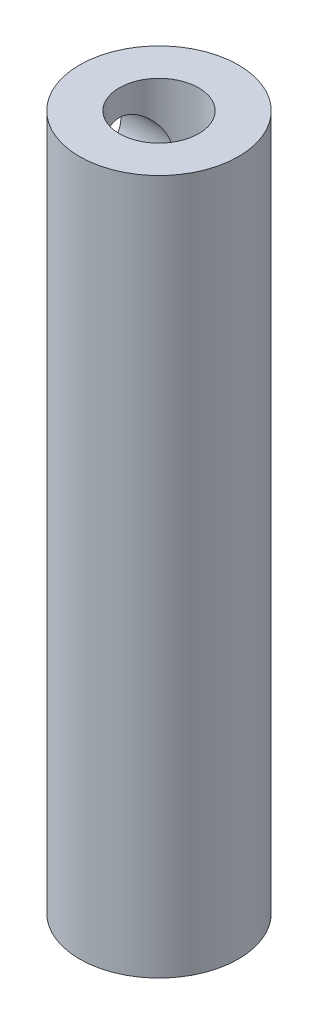
ISO-10303-21;
HEADER;
FILE_DESCRIPTION(('STEP AP214'),'2;1');
FILE_NAME('part.step','',(''),(''),'','','');
FILE_SCHEMA(('AUTOMOTIVE_DESIGN { 1 0 10303 214 1 1 1 1 }'));
ENDSEC;
DATA;
#1=APPLICATION_CONTEXT('core data for automotive mechanical design processes');
#2=APPLICATION_PROTOCOL_DEFINITION('international standard','automotive_design',2000,#1);
#3=PRODUCT_CONTEXT('',#1,'mechanical');
#4=PRODUCT('Part','Part','',(#3));
#5=PRODUCT_RELATED_PRODUCT_CATEGORY('part','',(#4));
#6=PRODUCT_DEFINITION_FORMATION('','',#4);
#7=PRODUCT_DEFINITION_CONTEXT('part definition',#1,'design');
#8=PRODUCT_DEFINITION('design','',#6,#7);
#9=PRODUCT_DEFINITION_SHAPE('','',#8);
#10=(LENGTH_UNIT() NAMED_UNIT(*) SI_UNIT(.MILLI.,.METRE.));
#11=(NAMED_UNIT(*) PLANE_ANGLE_UNIT() SI_UNIT($,.RADIAN.));
#12=(NAMED_UNIT(*) SI_UNIT($,.STERADIAN.) SOLID_ANGLE_UNIT());
#13=UNCERTAINTY_MEASURE_WITH_UNIT(LENGTH_MEASURE(1.E-05),#10,'distance_accuracy_value','');
#14=(GEOMETRIC_REPRESENTATION_CONTEXT(3) GLOBAL_UNCERTAINTY_ASSIGNED_CONTEXT((#13)) GLOBAL_UNIT_ASSIGNED_CONTEXT((#10,
#11,#12)) REPRESENTATION_CONTEXT('',''));
#15=CARTESIAN_POINT('',(0.,0.,0.));
#16=DIRECTION('',(0.,0.,1.));
#17=DIRECTION('',(1.,0.,0.));
#18=AXIS2_PLACEMENT_3D('',#15,#16,#17);
#19=CARTESIAN_POINT('',(0.,35.,0.));
#20=DIRECTION('',(0.,-1.,0.));
#21=DIRECTION('',(0.,0.,-1.));
#22=AXIS2_PLACEMENT_3D('',#19,#20,#21);
#23=CYLINDRICAL_SURFACE('',#22,4.);
#24=CARTESIAN_POINT('',(-3.62077339804634,32.,1.7));
#25=CARTESIAN_POINT('',(-3.62078389776822,31.9095136925962,1.69998931587784));
#26=CARTESIAN_POINT('',(-3.62421505367056,31.818887436566,1.69272971233163));
#27=CARTESIAN_POINT('',(-3.63750095648767,31.6402616540762,1.66397708018132));
#28=CARTESIAN_POINT('',(-3.64737281734679,31.5522697809394,1.64244612797097));
#29=CARTESIAN_POINT('',(-3.67220059629412,31.3818244806839,1.58615188365144));
#30=CARTESIAN_POINT('',(-3.68713519255218,31.2993495351598,1.55144401409242));
#31=CARTESIAN_POINT('',(-3.72037538198184,31.1414157505776,1.46994425999662));
#32=CARTESIAN_POINT('',(-3.73868027222187,31.0659554534262,1.42315489444196));
#33=CARTESIAN_POINT('',(-3.77792419156349,30.919259320318,1.31557971646441));
#34=CARTESIAN_POINT('',(-3.79895480957319,30.8485324995426,1.25413286768261));
#35=CARTESIAN_POINT('',(-3.84052932399883,30.7180095016102,1.12037385385952));
#36=CARTESIAN_POINT('',(-3.86107302551083,30.6582176392885,1.0480574201965));
#37=CARTESIAN_POINT('',(-3.90047994287595,30.5486282225362,0.890578070051302));
#38=CARTESIAN_POINT('',(-3.91922435158922,30.499408386334,0.804980679500432));
#39=CARTESIAN_POINT('',(-3.9517936883622,30.4162886166107,0.625779619556143));
#40=CARTESIAN_POINT('',(-3.96562088331569,30.3823816217372,0.532179664191152));
#41=CARTESIAN_POINT('',(-3.98614740911361,30.332710381214,0.344979513320471));
#42=CARTESIAN_POINT('',(-3.99319065604463,30.3160670178677,0.251651070591721));
#43=CARTESIAN_POINT('',(-4.00060815688424,30.2985497752618,0.0632783663420337));
#44=CARTESIAN_POINT('',(-4.00098523182037,30.2976692254058,-0.0317651523372097));
#45=CARTESIAN_POINT('',(-3.99522684956492,30.3112529689857,-0.214458466615303));
#46=CARTESIAN_POINT('',(-3.98950193441317,30.324749910631,-0.302195592459981));
#47=CARTESIAN_POINT('',(-3.97275194397345,30.3650406061082,-0.474021630551051));
#48=CARTESIAN_POINT('',(-3.96172647725524,30.3918353419478,-0.558110272867535));
#49=CARTESIAN_POINT('',(-3.93522368744884,30.4582722750843,-0.721803742779873));
#50=CARTESIAN_POINT('',(-3.91968084499471,30.4981047279113,-0.801320306141919));
#51=CARTESIAN_POINT('',(-3.88565313854627,30.5892953008207,-0.952749650325255));
#52=CARTESIAN_POINT('',(-3.86716722297728,30.640657543254,-1.02465969795704));
#53=CARTESIAN_POINT('',(-3.82750663559037,30.757800507865,-1.16440871156805));
#54=CARTESIAN_POINT('',(-3.80623419529478,30.8243594975726,-1.23156848333512));
#55=CARTESIAN_POINT('',(-3.76439681745492,30.9678239513226,-1.35407381215316));
#56=CARTESIAN_POINT('',(-3.74383217834637,31.0447337141281,-1.40941443577706));
#57=CARTESIAN_POINT('',(-3.70502399721272,31.2101401688352,-1.50855500222399));
#58=CARTESIAN_POINT('',(-3.68688823684044,31.2989504039897,-1.55187769268165));
#59=CARTESIAN_POINT('',(-3.65628757041348,31.4835805163489,-1.62267252189394));
#60=CARTESIAN_POINT('',(-3.64381842070352,31.5793950854602,-1.6501565261958));
#61=CARTESIAN_POINT('',(-3.62702749350719,31.7684983019597,-1.68672841059021));
#62=CARTESIAN_POINT('',(-3.62221773340993,31.8615291175216,-1.69692109964447));
#63=CARTESIAN_POINT('',(-3.61989322841417,32.0480762325109,-1.70187704278063));
#64=CARTESIAN_POINT('',(-3.62237578496444,32.1415923395692,-1.69664600447243));
#65=CARTESIAN_POINT('',(-3.63385039181918,32.3197683825884,-1.67191223339995));
#66=CARTESIAN_POINT('',(-3.64238974686291,32.4045989220652,-1.65340103574668));
#67=CARTESIAN_POINT('',(-3.66442865789702,32.5698728304785,-1.60396059683754));
#68=CARTESIAN_POINT('',(-3.67792940476492,32.650315140785,-1.57302837401107));
#69=CARTESIAN_POINT('',(-3.7090779402313,32.8084134508917,-1.49814807525468));
#70=CARTESIAN_POINT('',(-3.72687955099295,32.8857993962254,-1.45369590780971));
#71=CARTESIAN_POINT('',(-3.76441339227635,33.0323950596591,-1.35353226876144));
#72=CARTESIAN_POINT('',(-3.78414647967388,33.1016011185229,-1.29781578809865));
#73=CARTESIAN_POINT('',(-3.82535166604392,33.2360237838682,-1.17110429325259));
#74=CARTESIAN_POINT('',(-3.84682843975983,33.3003957330982,-1.09921112338328));
#75=CARTESIAN_POINT('',(-3.88754721100944,33.416324110372,-0.945155108949408));
#76=CARTESIAN_POINT('',(-3.90678900343043,33.4678793626733,-0.862991323245852));
#77=CARTESIAN_POINT('',(-3.94103107719546,33.556733022639,-0.689980032155145));
#78=CARTESIAN_POINT('',(-3.95601331647128,33.5939710147984,-0.599097707378483));
#79=CARTESIAN_POINT('',(-3.97989121280153,33.6523470048471,-0.411555216738269));
#80=CARTESIAN_POINT('',(-3.98879065469919,33.6734950151868,-0.314898684498714));
#81=CARTESIAN_POINT('',(-3.9990489958153,33.6977931006144,-0.126084955840315));
#82=CARTESIAN_POINT('',(-4.00090603247313,33.7021326282122,-0.0341069160918674));
#83=CARTESIAN_POINT('',(-3.99826543244609,33.6959174191764,0.149241085779918));
#84=CARTESIAN_POINT('',(-3.99376899105789,33.6853654841136,0.240611159032687));
#85=CARTESIAN_POINT('',(-3.97919382980664,33.6505207493148,0.416560481880022));
#86=CARTESIAN_POINT('',(-3.96933380737085,33.6267655308726,0.501265842353938));
#87=CARTESIAN_POINT('',(-3.94513266199835,33.5667872702492,0.665447707792311));
#88=CARTESIAN_POINT('',(-3.93079070613533,33.5305619104791,0.744923237514438));
#89=CARTESIAN_POINT('',(-3.8981931765112,33.4448358087029,0.900380438212713));
#90=CARTESIAN_POINT('',(-3.87978917350281,33.3948058369909,0.976038394360143));
#91=CARTESIAN_POINT('',(-3.84122862577445,33.2836481674676,1.118211865535));
#92=CARTESIAN_POINT('',(-3.8210714015288,33.2225161565732,1.18472380967696));
#93=CARTESIAN_POINT('',(-3.77946315895161,33.0857613862788,1.31165271688526));
#94=CARTESIAN_POINT('',(-3.75802228942074,33.0094164933923,1.37129773860273));
#95=CARTESIAN_POINT('',(-3.71772952713886,32.8471570184193,1.47705876845357));
#96=CARTESIAN_POINT('',(-3.69887912452728,32.7612369793602,1.52316700687638));
#97=CARTESIAN_POINT('',(-3.66623132404758,32.582210832153,1.60015623012625));
#98=CARTESIAN_POINT('',(-3.65241922289075,32.4891266098767,1.63108161598059));
#99=CARTESIAN_POINT('',(-3.63183106374555,32.2984664254959,1.67643974797453));
#100=CARTESIAN_POINT('',(-3.62503141264755,32.2009066860975,1.69092781340853));
#101=CARTESIAN_POINT('',(-3.62125776494451,32.0686373471819,1.69896477261701));
#102=CARTESIAN_POINT('',(-3.62076941465609,32.0343287449659,1.70000405334813));
#103=CARTESIAN_POINT('',(-3.62077339804634,32.,1.7));
#104=B_SPLINE_CURVE_WITH_KNOTS('',3,(#24,#25,#26,#27,#28,#29,#30,#31,#32,#33,#34,#35,#36,#37,
#38,#39,#40,#41,#42,#43,#44,#45,#46,#47,#48,#49,#50,#51,#52,#53,#54,#55,#56,#57,#58,#59,#60,#61,
#62,#63,#64,#65,#66,#67,#68,#69,#70,#71,#72,#73,#74,#75,#76,#77,#78,#79,#80,#81,#82,#83,#84,#85,
#86,#87,#88,#89,#90,#91,#92,#93,#94,#95,#96,#97,#98,#99,#100,#101,#102,#103),.UNSPECIFIED.,.T.,
.F.,(4,2,2,2,2,2,2,2,2,2,2,2,2,2,2,2,2,2,2,2,2,2,2,2,2,2,2,2,2,2,2,2,2,2,2,2,2,2,2,4),(0.,
0.271357429217211,0.543438849684194,0.81438834225994,1.08528138763888,1.3720970991645,
1.65902574252361,1.95899463692504,2.25882506229057,2.54250020592688,2.82605529947181,
3.09166970443069,3.35730372725016,3.62700110584538,3.89679506582232,4.18626169238784,
4.47584891000081,4.77567555447247,5.07527729092642,5.35489435511071,5.63440795890816,
5.89497300357031,6.15560063227203,6.42747562422463,6.69947178160411,6.99468311182854,
7.28992151334518,7.58639242540035,7.88267869873597,8.15756828963533,8.4324061717119,
8.69679659632972,8.96123618473687,9.23771295195231,9.51429735959075,9.81058879533077,
10.1070499625391,10.4026389106496,10.6972300845991,10.800177815029),.UNSPECIFIED.);
#105=CARTESIAN_POINT('',(-3.62077339804634,32.,1.7));
#106=VERTEX_POINT('',#105);
#107=EDGE_CURVE('E10',#106,#106,#104,.T.);
#108=ORIENTED_EDGE('',*,*,#107,.T.);
#109=EDGE_LOOP('',(#108));
#110=FACE_BOUND('',#109,.T.);
#111=CARTESIAN_POINT('',(0.,35.,0.));
#112=DIRECTION('',(0.,1.,0.));
#113=DIRECTION('',(0.,0.,1.));
#114=AXIS2_PLACEMENT_3D('',#111,#112,#113);
#115=CIRCLE('',#114,4.);
#116=CARTESIAN_POINT('',(0.,35.,4.));
#117=VERTEX_POINT('',#116);
#118=EDGE_CURVE('E40',#117,#117,#115,.T.);
#119=ORIENTED_EDGE('',*,*,#118,.F.);
#120=EDGE_LOOP('',(#119));
#121=FACE_BOUND('',#120,.T.);
#122=CARTESIAN_POINT('',(0.,0.,0.));
#123=DIRECTION('',(0.,1.,0.));
#124=DIRECTION('',(0.,0.,1.));
#125=AXIS2_PLACEMENT_3D('',#122,#123,#124);
#126=CIRCLE('',#125,4.);
#127=CARTESIAN_POINT('',(0.,0.,4.));
#128=VERTEX_POINT('',#127);
#129=EDGE_CURVE('E44',#128,#128,#126,.T.);
#130=ORIENTED_EDGE('',*,*,#129,.T.);
#131=EDGE_LOOP('',(#130));
#132=FACE_BOUND('',#131,.T.);
#133=ADVANCED_FACE('F30',(#110,#121,#132),#23,.T.);
#134=CARTESIAN_POINT('',(0.,35.,0.));
#135=DIRECTION('',(0.,1.,0.));
#136=DIRECTION('',(0.,0.,1.));
#137=AXIS2_PLACEMENT_3D('',#134,#135,#136);
#138=PLANE('',#137);
#139=CARTESIAN_POINT('',(0.,35.,0.));
#140=DIRECTION('',(0.,1.,0.));
#141=DIRECTION('',(0.,0.,1.));
#142=AXIS2_PLACEMENT_3D('',#139,#140,#141);
#143=CIRCLE('',#142,2.);
#144=CARTESIAN_POINT('',(0.,35.,2.));
#145=VERTEX_POINT('',#144);
#146=EDGE_CURVE('E51',#145,#145,#143,.T.);
#147=ORIENTED_EDGE('',*,*,#146,.F.);
#148=EDGE_LOOP('',(#147));
#149=FACE_BOUND('',#148,.T.);
#150=ORIENTED_EDGE('',*,*,#118,.T.);
#151=EDGE_LOOP('',(#150));
#152=FACE_BOUND('',#151,.T.);
#153=ADVANCED_FACE('F79',(#149,#152),#138,.T.);
#154=CARTESIAN_POINT('',(0.,0.,0.));
#155=DIRECTION('',(0.,1.,0.));
#156=DIRECTION('',(0.,0.,1.));
#157=AXIS2_PLACEMENT_3D('',#154,#155,#156);
#158=PLANE('',#157);
#159=ORIENTED_EDGE('',*,*,#129,.F.);
#160=EDGE_LOOP('',(#159));
#161=FACE_BOUND('',#160,.T.);
#162=ADVANCED_FACE('F76',(#161),#158,.F.);
#163=CARTESIAN_POINT('',(0.,25.,0.));
#164=DIRECTION('',(0.,1.,0.));
#165=DIRECTION('',(0.,0.,1.));
#166=AXIS2_PLACEMENT_3D('',#163,#164,#165);
#167=CYLINDRICAL_SURFACE('',#166,2.);
#168=CARTESIAN_POINT('',(-1.05356537528528,32.,1.7));
#169=CARTESIAN_POINT('',(-1.0535865391497,32.0579969876084,1.69999209353776));
#170=CARTESIAN_POINT('',(-1.05846416247034,32.1160712056181,1.69699341427168));
#171=CARTESIAN_POINT('',(-1.07694415181595,32.2302941941207,1.68531810769261));
#172=CARTESIAN_POINT('',(-1.09057797998307,32.2864352489887,1.67662100293753));
#173=CARTESIAN_POINT('',(-1.13108259855175,32.4180078786746,1.64968082581871));
#174=CARTESIAN_POINT('',(-1.16108669082666,32.4919371171079,1.62898823756465));
#175=CARTESIAN_POINT('',(-1.22787010969714,32.6337248046924,1.57926447079485));
#176=CARTESIAN_POINT('',(-1.26467231483019,32.701561568797,1.55020494374478));
#177=CARTESIAN_POINT('',(-1.33159048933568,32.8152672380987,1.49274984380142));
#178=CARTESIAN_POINT('',(-1.36106425910824,32.8623743748959,1.46602060494138));
#179=CARTESIAN_POINT('',(-1.4206068170519,32.9535810134619,1.40840212528898));
#180=CARTESIAN_POINT('',(-1.4506758793521,32.9976790859571,1.37751092804804));
#181=CARTESIAN_POINT('',(-1.540391428907,33.1253921130372,1.27870069797039));
#182=CARTESIAN_POINT('',(-1.59967379601292,33.204629062381,1.20454185093214));
#183=CARTESIAN_POINT('',(-1.6991559367518,33.3335598904778,1.05779848838552));
#184=CARTESIAN_POINT('',(-1.74068803635965,33.385920768851,0.988441684600398));
#185=CARTESIAN_POINT('',(-1.81701226861221,33.480650604137,0.839882315936324));
#186=CARTESIAN_POINT('',(-1.85181552120821,33.523036071839,0.760696356430929));
#187=CARTESIAN_POINT('',(-1.90658117573437,33.5891273039267,0.608501762552866));
#188=CARTESIAN_POINT('',(-1.92808383853929,33.6148170149589,0.536914240950147));
#189=CARTESIAN_POINT('',(-1.96324342803797,33.6566395251948,0.389137658874133));
#190=CARTESIAN_POINT('',(-1.97690494882648,33.6727779206503,0.312951321808487));
#191=CARTESIAN_POINT('',(-1.99531639754419,33.6944973023532,0.157641560880517));
#192=CARTESIAN_POINT('',(-2.00002539694724,33.7000298022473,0.0785063262071438));
#193=CARTESIAN_POINT('',(-1.99997440786115,33.6999699681093,-0.0797561244111584));
#194=CARTESIAN_POINT('',(-1.99521519509274,33.6943785454486,-0.158883340481886));
#195=CARTESIAN_POINT('',(-1.97736113063873,33.6733154790453,-0.308737410975696));
#196=CARTESIAN_POINT('',(-1.96490923253137,33.6586056552615,-0.379652571436747));
#197=CARTESIAN_POINT('',(-1.93315996846712,33.6208673962779,-0.517596839641206));
#198=CARTESIAN_POINT('',(-1.91386152687525,33.5978376539564,-0.584625334838861));
#199=CARTESIAN_POINT('',(-1.86781902754465,33.5424026866156,-0.718801577563779));
#200=CARTESIAN_POINT('',(-1.84060628121434,33.5093993180463,-0.785538209496984));
#201=CARTESIAN_POINT('',(-1.78109652308424,33.436229850535,-0.912480875898615));
#202=CARTESIAN_POINT('',(-1.74879554087872,33.3960581547916,-0.972681747952854));
#203=CARTESIAN_POINT('',(-1.66367783669771,33.2881848025844,-1.11444505894733));
#204=CARTESIAN_POINT('',(-1.60862821526641,33.2167072637636,-1.19180461135557));
#205=CARTESIAN_POINT('',(-1.49519576454598,33.0622669623057,-1.33134355517151));
#206=CARTESIAN_POINT('',(-1.43680588820473,32.9792793488295,-1.39348927403084));
#207=CARTESIAN_POINT('',(-1.33560565081163,32.8225278157227,-1.48992153907624));
#208=CARTESIAN_POINT('',(-1.29228603965747,32.7509944251612,-1.52732903885879));
#209=CARTESIAN_POINT('',(-1.21115764881017,32.6007563716037,-1.59240971181971));
#210=CARTESIAN_POINT('',(-1.17333262599745,32.5220740117466,-1.62011193334315));
#211=CARTESIAN_POINT('',(-1.12174912939406,32.3880115626178,-1.65598220392296));
#212=CARTESIAN_POINT('',(-1.10429085307099,32.335007261131,-1.66757817522879));
#213=CARTESIAN_POINT('',(-1.07634688979503,32.2264025966488,-1.68575136889507));
#214=CARTESIAN_POINT('',(-1.06584358593808,32.170809177588,-1.69234127787066));
#215=CARTESIAN_POINT('',(-1.05364022423823,32.0576891921143,-1.69997188075843));
#216=CARTESIAN_POINT('',(-1.05202380560274,32.0001493702366,-1.70095985458385));
#217=CARTESIAN_POINT('',(-1.05819368520095,31.8857546666464,-1.69712521354873));
#218=CARTESIAN_POINT('',(-1.06598990302157,31.8289005714107,-1.69229646870194));
#219=CARTESIAN_POINT('',(-1.09174803921428,31.7063831938381,-1.67581445898948));
#220=CARTESIAN_POINT('',(-1.11144700712543,31.6412637551221,-1.66297849578291));
#221=CARTESIAN_POINT('',(-1.15819537133674,31.5153639909899,-1.63076153967505));
#222=CARTESIAN_POINT('',(-1.18527033957442,31.4545997078671,-1.61135771876846));
#223=CARTESIAN_POINT('',(-1.23839222376261,31.3478086163342,-1.57076420948407));
#224=CARTESIAN_POINT('',(-1.26376891139426,31.3010801036612,-1.55050252767248));
#225=CARTESIAN_POINT('',(-1.31613618649843,31.2103264983711,-1.50630785201208));
#226=CARTESIAN_POINT('',(-1.34312773977883,31.166303056138,-1.48237264746023));
#227=CARTESIAN_POINT('',(-1.42515792176047,31.0379984781566,-1.40518374468282));
#228=CARTESIAN_POINT('',(-1.48122788454067,30.9575276545874,-1.34656406295446));
#229=CARTESIAN_POINT('',(-1.59308814278739,30.8038523323277,-1.21245869465718));
#230=CARTESIAN_POINT('',(-1.64876806742133,30.7310941751382,-1.13636871801782));
#231=CARTESIAN_POINT('',(-1.75240887594904,30.5990734955405,-0.968861849498815));
#232=CARTESIAN_POINT('',(-1.80039286591852,30.5397703450762,-0.877492585814875));
#233=CARTESIAN_POINT('',(-1.8705603997189,30.4542373032738,-0.711602749491723));
#234=CARTESIAN_POINT('',(-1.89611023700009,30.4234733378396,-0.64083760329226));
#235=CARTESIAN_POINT('',(-1.93962462353878,30.3713961005599,-0.493683487802223));
#236=CARTESIAN_POINT('',(-1.9575948217246,30.350075789982,-0.417298756698768));
#237=CARTESIAN_POINT('',(-1.98460480421611,30.3181172086044,-0.260242591839756));
#238=CARTESIAN_POINT('',(-1.99358857090647,30.3075459361047,-0.179547531981826));
#239=CARTESIAN_POINT('',(-2.00158035195772,30.2981390046393,-0.0169856320256852));
#240=CARTESIAN_POINT('',(-2.00059177312242,30.2992993378625,0.0648807983594134));
#241=CARTESIAN_POINT('',(-1.98932419140323,30.3125699293231,0.21907037132619));
#242=CARTESIAN_POINT('',(-1.97994433068417,30.3236204805623,0.29155638997955));
#243=CARTESIAN_POINT('',(-1.95384288748472,30.3545303540401,0.433231940291043));
#244=CARTESIAN_POINT('',(-1.93711972391115,30.3743915733211,0.50242075846762));
#245=CARTESIAN_POINT('',(-1.89653927098457,30.422962384739,0.639099574523981));
#246=CARTESIAN_POINT('',(-1.87239791787222,30.4520260370968,0.706377365385048));
#247=CARTESIAN_POINT('',(-1.81872179526714,30.5174022780211,0.834932229603046));
#248=CARTESIAN_POINT('',(-1.78918566938265,30.5537166898389,0.896207787870503));
#249=CARTESIAN_POINT('',(-1.71091060380423,30.6515005503062,1.0403705430262));
#250=CARTESIAN_POINT('',(-1.65977349850707,30.7166626502332,1.11945639862046));
#251=CARTESIAN_POINT('',(-1.55283945613768,30.8582842851909,1.26363362707695));
#252=CARTESIAN_POINT('',(-1.49702395653074,30.934789848882,1.32866519761275));
#253=CARTESIAN_POINT('',(-1.41297411987472,31.057979028225,1.41604686738013));
#254=CARTESIAN_POINT('',(-1.38462093167345,31.1009153762359,1.44370098494875));
#255=CARTESIAN_POINT('',(-1.32876164714129,31.1895686034912,1.49527077077826));
#256=CARTESIAN_POINT('',(-1.30125604387866,31.2352870568377,1.51918429479166));
#257=CARTESIAN_POINT('',(-1.24826463387982,31.3294235289084,1.56301367792193));
#258=CARTESIAN_POINT('',(-1.22277046023881,31.3778287629546,1.58294669002176));
#259=CARTESIAN_POINT('',(-1.17511740131887,31.4776773758036,1.61863632739282));
#260=CARTESIAN_POINT('',(-1.15295358494648,31.529116102618,1.63439915410738));
#261=CARTESIAN_POINT('',(-1.1139561494244,31.6348935805192,1.66122222386113));
#262=CARTESIAN_POINT('',(-1.09709510990122,31.6892156564824,1.67230676348317));
#263=CARTESIAN_POINT('',(-1.07097877600694,31.8003484786753,1.689159508811));
#264=CARTESIAN_POINT('',(-1.06169078613592,31.8571473992388,1.69495058152883));
#265=CARTESIAN_POINT('',(-1.05472385187238,31.9428584986647,1.69928151774383));
#266=CARTESIAN_POINT('',(-1.05355494602029,31.9714198720766,1.70000389619722));
#267=CARTESIAN_POINT('',(-1.05356537528528,32.,1.7));
#268=B_SPLINE_CURVE_WITH_KNOTS('',3,(#168,#169,#170,#171,#172,#173,#174,#175,#176,#177,#178,
#179,#180,#181,#182,#183,#184,#185,#186,#187,#188,#189,#190,#191,#192,#193,#194,#195,#196,#197,
#198,#199,#200,#201,#202,#203,#204,#205,#206,#207,#208,#209,#210,#211,#212,#213,#214,#215,#216,
#217,#218,#219,#220,#221,#222,#223,#224,#225,#226,#227,#228,#229,#230,#231,#232,#233,#234,#235,
#236,#237,#238,#239,#240,#241,#242,#243,#244,#245,#246,#247,#248,#249,#250,#251,#252,#253,#254,
#255,#256,#257,#258,#259,#260,#261,#262,#263,#264,#265,#266,#267),.UNSPECIFIED.,.T.,.F.,(4,2,2,
2,2,2,2,2,2,2,2,2,2,2,2,2,2,2,2,2,2,2,2,2,2,2,2,2,2,2,2,2,2,2,2,2,2,2,2,2,2,2,2,2,2,2,2,2,2,4),
(0.,0.173879418884634,0.34838713050625,0.594273916217876,0.841003812098058,1.02576540468018,
1.2106141547992,1.57953716462817,1.86747817174354,2.15493918820206,2.39107901360164,
2.6270803439883,2.86415803868535,3.1012163106546,3.32073083217672,3.54027985609209,
3.77721956251101,4.0143450798563,4.36900968073956,4.72445229908044,4.99861224866161,
5.27194447018501,5.44239988394004,5.61242186648947,5.78404131184428,5.95584177779075,
6.16238745176459,6.36965851995739,6.54014677695168,6.71073803794905,7.05207950002438,
7.40773795752544,7.76230775425531,8.00521725422385,8.24794539815097,8.49217735008232,
8.73632586906829,8.95708375667679,9.1778891991903,9.40850919092569,9.63918724678179,
9.98094346037337,10.3241264325837,10.499217898416,10.6744093682521,10.8488287825195,
11.0229873424942,11.1962299392967,11.3687205667594,11.4544059831902),.UNSPECIFIED.);
#269=CARTESIAN_POINT('',(-1.05356537528528,32.,1.7));
#270=VERTEX_POINT('',#269);
#271=EDGE_CURVE('E54',#270,#270,#268,.T.);
#272=ORIENTED_EDGE('',*,*,#271,.T.);
#273=EDGE_LOOP('',(#272));
#274=FACE_BOUND('',#273,.T.);
#275=CARTESIAN_POINT('',(0.,25.,0.));
#276=DIRECTION('',(0.,1.,0.));
#277=DIRECTION('',(0.,0.,1.));
#278=AXIS2_PLACEMENT_3D('',#275,#276,#277);
#279=CIRCLE('',#278,2.);
#280=CARTESIAN_POINT('',(0.,25.,2.));
#281=VERTEX_POINT('',#280);
#282=EDGE_CURVE('E49',#281,#281,#279,.T.);
#283=ORIENTED_EDGE('',*,*,#282,.F.);
#284=EDGE_LOOP('',(#283));
#285=FACE_BOUND('',#284,.T.);
#286=ORIENTED_EDGE('',*,*,#146,.T.);
#287=EDGE_LOOP('',(#286));
#288=FACE_BOUND('',#287,.T.);
#289=ADVANCED_FACE('F61',(#274,#285,#288),#167,.F.);
#290=CARTESIAN_POINT('',(0.,25.,0.));
#291=DIRECTION('',(0.,1.,0.));
#292=DIRECTION('',(0.,0.,1.));
#293=AXIS2_PLACEMENT_3D('',#290,#291,#292);
#294=PLANE('',#293);
#295=ORIENTED_EDGE('',*,*,#282,.T.);
#296=EDGE_LOOP('',(#295));
#297=FACE_BOUND('',#296,.T.);
#298=ADVANCED_FACE('F68',(#297),#294,.T.);
#299=CARTESIAN_POINT('',(-4.,32.,0.));
#300=DIRECTION('',(-1.,0.,0.));
#301=DIRECTION('',(0.,0.,1.));
#302=AXIS2_PLACEMENT_3D('',#299,#300,#301);
#303=CYLINDRICAL_SURFACE('',#302,1.7);
#304=ORIENTED_EDGE('',*,*,#107,.F.);
#305=EDGE_LOOP('',(#304));
#306=FACE_BOUND('',#305,.T.);
#307=ORIENTED_EDGE('',*,*,#271,.F.);
#308=EDGE_LOOP('',(#307));
#309=FACE_BOUND('',#308,.T.);
#310=ADVANCED_FACE('F65',(#306,#309),#303,.F.);
#311=CLOSED_SHELL('',(#133,#153,#162,#289,#298,#310));
#312=MANIFOLD_SOLID_BREP('B2',#311);
#313=ADVANCED_BREP_SHAPE_REPRESENTATION('',(#18,#312),#14);
#314=SHAPE_DEFINITION_REPRESENTATION(#9,#313);
ENDSEC;
END-ISO-10303-21;
